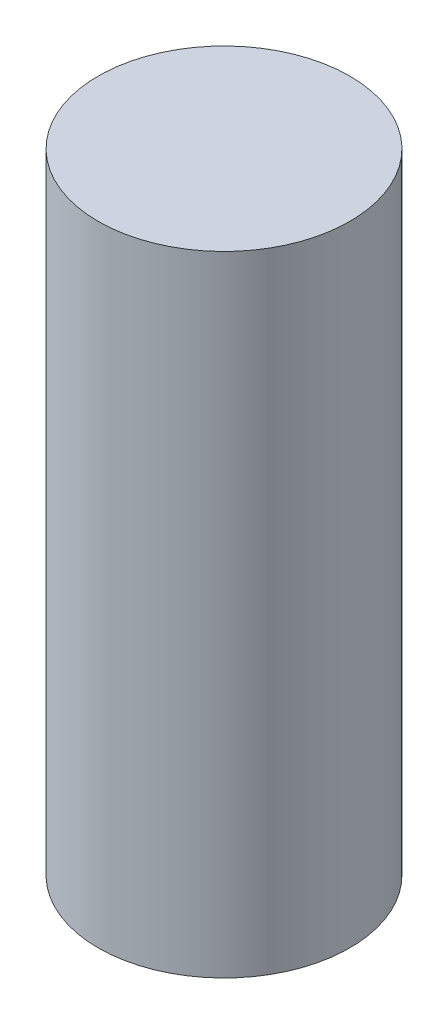
ISO-10303-21;
HEADER;
FILE_DESCRIPTION(('STEP AP214'),'2;1');
FILE_NAME('part.step','',(''),(''),'','','');
FILE_SCHEMA(('AUTOMOTIVE_DESIGN { 1 0 10303 214 1 1 1 1 }'));
ENDSEC;
DATA;
#1=APPLICATION_CONTEXT('core data for automotive mechanical design processes');
#2=APPLICATION_PROTOCOL_DEFINITION('international standard','automotive_design',2000,#1);
#3=PRODUCT_CONTEXT('',#1,'mechanical');
#4=PRODUCT('Part','Part','',(#3));
#5=PRODUCT_RELATED_PRODUCT_CATEGORY('part','',(#4));
#6=PRODUCT_DEFINITION_FORMATION('','',#4);
#7=PRODUCT_DEFINITION_CONTEXT('part definition',#1,'design');
#8=PRODUCT_DEFINITION('design','',#6,#7);
#9=PRODUCT_DEFINITION_SHAPE('','',#8);
#10=(LENGTH_UNIT() NAMED_UNIT(*) SI_UNIT(.MILLI.,.METRE.));
#11=(NAMED_UNIT(*) PLANE_ANGLE_UNIT() SI_UNIT($,.RADIAN.));
#12=(NAMED_UNIT(*) SI_UNIT($,.STERADIAN.) SOLID_ANGLE_UNIT());
#13=UNCERTAINTY_MEASURE_WITH_UNIT(LENGTH_MEASURE(1.E-05),#10,'distance_accuracy_value','');
#14=(GEOMETRIC_REPRESENTATION_CONTEXT(3) GLOBAL_UNCERTAINTY_ASSIGNED_CONTEXT((#13)) GLOBAL_UNIT_ASSIGNED_CONTEXT((#10,
#11,#12)) REPRESENTATION_CONTEXT('',''));
#15=CARTESIAN_POINT('',(0.,0.,0.));
#16=DIRECTION('',(0.,0.,1.));
#17=DIRECTION('',(1.,0.,0.));
#18=AXIS2_PLACEMENT_3D('',#15,#16,#17);
#19=CARTESIAN_POINT('',(0.,25.,0.));
#20=DIRECTION('',(0.,-1.,0.));
#21=DIRECTION('',(0.,0.,-1.));
#22=AXIS2_PLACEMENT_3D('',#19,#20,#21);
#23=CYLINDRICAL_SURFACE('',#22,5.);
#24=CARTESIAN_POINT('',(0.,25.,0.));
#25=DIRECTION('',(0.,1.,0.));
#26=DIRECTION('',(0.,0.,1.));
#27=AXIS2_PLACEMENT_3D('',#24,#25,#26);
#28=CIRCLE('',#27,5.);
#29=CARTESIAN_POINT('',(0.,25.,5.));
#30=VERTEX_POINT('',#29);
#31=EDGE_CURVE('E10',#30,#30,#28,.T.);
#32=ORIENTED_EDGE('',*,*,#31,.F.);
#33=EDGE_LOOP('',(#32));
#34=FACE_BOUND('',#33,.T.);
#35=CARTESIAN_POINT('',(0.,0.,0.));
#36=DIRECTION('',(0.,1.,0.));
#37=DIRECTION('',(0.,0.,1.));
#38=AXIS2_PLACEMENT_3D('',#35,#36,#37);
#39=CIRCLE('',#38,5.);
#40=CARTESIAN_POINT('',(0.,0.,5.));
#41=VERTEX_POINT('',#40);
#42=EDGE_CURVE('E36',#41,#41,#39,.T.);
#43=ORIENTED_EDGE('',*,*,#42,.T.);
#44=EDGE_LOOP('',(#43));
#45=FACE_BOUND('',#44,.T.);
#46=ADVANCED_FACE('F33',(#34,#45),#23,.T.);
#47=CARTESIAN_POINT('',(0.,25.,0.));
#48=DIRECTION('',(0.,1.,0.));
#49=DIRECTION('',(0.,0.,1.));
#50=AXIS2_PLACEMENT_3D('',#47,#48,#49);
#51=PLANE('',#50);
#52=ORIENTED_EDGE('',*,*,#31,.T.);
#53=EDGE_LOOP('',(#52));
#54=FACE_BOUND('',#53,.T.);
#55=ADVANCED_FACE('F48',(#54),#51,.T.);
#56=CARTESIAN_POINT('',(0.,0.,0.));
#57=DIRECTION('',(0.,1.,0.));
#58=DIRECTION('',(0.,0.,1.));
#59=AXIS2_PLACEMENT_3D('',#56,#57,#58);
#60=PLANE('',#59);
#61=ORIENTED_EDGE('',*,*,#42,.F.);
#62=EDGE_LOOP('',(#61));
#63=FACE_BOUND('',#62,.T.);
#64=ADVANCED_FACE('F46',(#63),#60,.F.);
#65=CLOSED_SHELL('',(#46,#55,#64));
#66=MANIFOLD_SOLID_BREP('B2',#65);
#67=ADVANCED_BREP_SHAPE_REPRESENTATION('',(#18,#66),#14);
#68=SHAPE_DEFINITION_REPRESENTATION(#9,#67);
ENDSEC;
END-ISO-10303-21;
